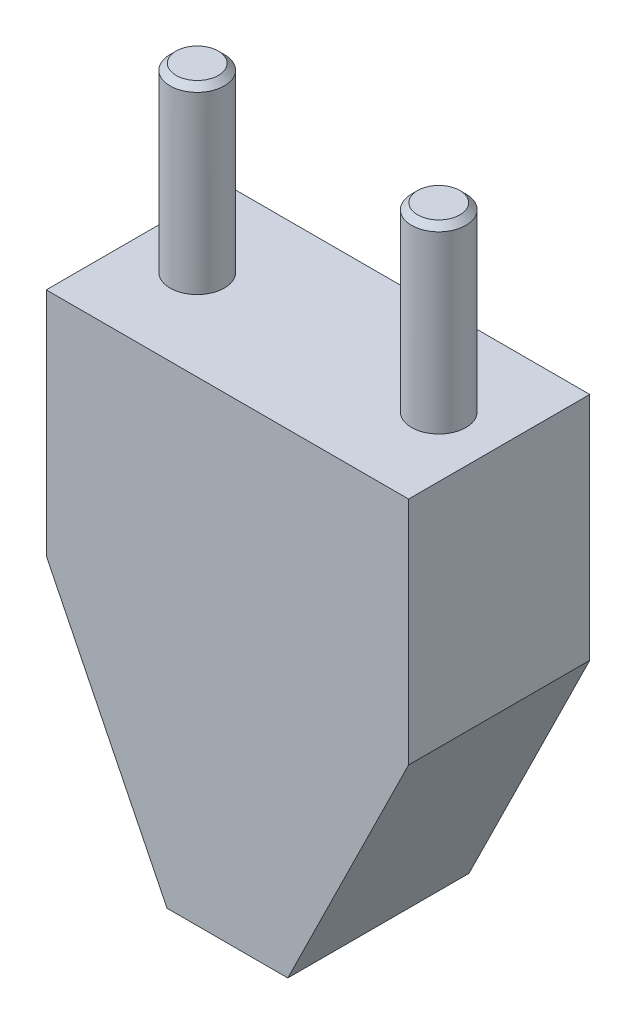
ISO-10303-21;
HEADER;
FILE_DESCRIPTION(('STEP AP214'),'2;1');
FILE_NAME('part.step','',(''),(''),'','','');
FILE_SCHEMA(('AUTOMOTIVE_DESIGN { 1 0 10303 214 1 1 1 1 }'));
ENDSEC;
DATA;
#1=APPLICATION_CONTEXT('core data for automotive mechanical design processes');
#2=APPLICATION_PROTOCOL_DEFINITION('international standard','automotive_design',2000,#1);
#3=PRODUCT_CONTEXT('',#1,'mechanical');
#4=PRODUCT('Part','Part','',(#3));
#5=PRODUCT_RELATED_PRODUCT_CATEGORY('part','',(#4));
#6=PRODUCT_DEFINITION_FORMATION('','',#4);
#7=PRODUCT_DEFINITION_CONTEXT('part definition',#1,'design');
#8=PRODUCT_DEFINITION('design','',#6,#7);
#9=PRODUCT_DEFINITION_SHAPE('','',#8);
#10=(LENGTH_UNIT() NAMED_UNIT(*) SI_UNIT(.MILLI.,.METRE.));
#11=(NAMED_UNIT(*) PLANE_ANGLE_UNIT() SI_UNIT($,.RADIAN.));
#12=(NAMED_UNIT(*) SI_UNIT($,.STERADIAN.) SOLID_ANGLE_UNIT());
#13=UNCERTAINTY_MEASURE_WITH_UNIT(LENGTH_MEASURE(1.E-05),#10,'distance_accuracy_value','');
#14=(GEOMETRIC_REPRESENTATION_CONTEXT(3) GLOBAL_UNCERTAINTY_ASSIGNED_CONTEXT((#13)) GLOBAL_UNIT_ASSIGNED_CONTEXT((#10,
#11,#12)) REPRESENTATION_CONTEXT('',''));
#15=CARTESIAN_POINT('',(0.,0.,0.));
#16=DIRECTION('',(0.,0.,1.));
#17=DIRECTION('',(1.,0.,0.));
#18=AXIS2_PLACEMENT_3D('',#15,#16,#17);
#19=CARTESIAN_POINT('',(-21.2832970929522,-19.069471621051,15.));
#20=DIRECTION('',(1.,0.,0.));
#21=DIRECTION('',(0.,1.,0.));
#22=AXIS2_PLACEMENT_3D('',#19,#20,#21);
#23=PLANE('',#22);
#24=DIRECTION('',(0.,-1.,0.));
#25=VECTOR('',#24,1.);
#26=CARTESIAN_POINT('',(-21.2832970929522,-19.069471621051,0.));
#27=LINE('',#26,#25);
#28=CARTESIAN_POINT('',(-21.2832970929522,0.,0.));
#29=VERTEX_POINT('',#28);
#30=CARTESIAN_POINT('',(-21.2832970929522,-19.069471621051,0.));
#31=VERTEX_POINT('',#30);
#32=EDGE_CURVE('E128',#29,#31,#27,.T.);
#33=ORIENTED_EDGE('',*,*,#32,.T.);
#34=DIRECTION('',(0.,0.,-1.));
#35=VECTOR('',#34,1.);
#36=CARTESIAN_POINT('',(-21.2832970929522,-19.069471621051,15.));
#37=LINE('',#36,#35);
#38=CARTESIAN_POINT('',(-21.2832970929522,-19.069471621051,15.));
#39=VERTEX_POINT('',#38);
#40=EDGE_CURVE('E156',#39,#31,#37,.T.);
#41=ORIENTED_EDGE('',*,*,#40,.F.);
#42=DIRECTION('',(0.,-1.,0.));
#43=VECTOR('',#42,1.);
#44=CARTESIAN_POINT('',(-21.2832970929522,-19.069471621051,15.));
#45=LINE('',#44,#43);
#46=CARTESIAN_POINT('',(-21.2832970929522,0.,15.));
#47=VERTEX_POINT('',#46);
#48=EDGE_CURVE('E145',#47,#39,#45,.T.);
#49=ORIENTED_EDGE('',*,*,#48,.F.);
#50=DIRECTION('',(0.,0.,-1.));
#51=VECTOR('',#50,1.);
#52=CARTESIAN_POINT('',(-21.2832970929522,0.,15.));
#53=LINE('',#52,#51);
#54=EDGE_CURVE('E124',#47,#29,#53,.T.);
#55=ORIENTED_EDGE('',*,*,#54,.T.);
#56=EDGE_LOOP('',(#33,#41,#49,#55));
#57=FACE_BOUND('',#56,.T.);
#58=ADVANCED_FACE('F37',(#57),#23,.F.);
#59=CARTESIAN_POINT('',(-11.2832970929522,-39.3443866876167,15.));
#60=DIRECTION('',(0.896846097486574,0.442342714897739,0.));
#61=DIRECTION('',(-0.442342714897739,0.896846097486574,0.));
#62=AXIS2_PLACEMENT_3D('',#59,#60,#61);
#63=PLANE('',#62);
#64=DIRECTION('',(0.442342714897739,-0.896846097486574,0.));
#65=VECTOR('',#64,1.);
#66=CARTESIAN_POINT('',(-11.2832970929522,-39.3443866876167,0.));
#67=LINE('',#66,#65);
#68=CARTESIAN_POINT('',(-11.2832970929522,-39.3443866876167,0.));
#69=VERTEX_POINT('',#68);
#70=EDGE_CURVE('E132',#31,#69,#67,.T.);
#71=ORIENTED_EDGE('',*,*,#70,.T.);
#72=DIRECTION('',(0.,0.,-1.));
#73=VECTOR('',#72,1.);
#74=CARTESIAN_POINT('',(-11.2832970929522,-39.3443866876167,15.));
#75=LINE('',#74,#73);
#76=CARTESIAN_POINT('',(-11.2832970929522,-39.3443866876167,15.));
#77=VERTEX_POINT('',#76);
#78=EDGE_CURVE('E152',#77,#69,#75,.T.);
#79=ORIENTED_EDGE('',*,*,#78,.F.);
#80=DIRECTION('',(0.442342714897739,-0.896846097486574,0.));
#81=VECTOR('',#80,1.);
#82=CARTESIAN_POINT('',(-11.2832970929522,-39.3443866876167,15.));
#83=LINE('',#82,#81);
#84=EDGE_CURVE('E93',#39,#77,#83,.T.);
#85=ORIENTED_EDGE('',*,*,#84,.F.);
#86=ORIENTED_EDGE('',*,*,#40,.T.);
#87=EDGE_LOOP('',(#71,#79,#85,#86));
#88=FACE_BOUND('',#87,.T.);
#89=ADVANCED_FACE('F194',(#88),#63,.F.);
#90=CARTESIAN_POINT('',(-1.28329709295219,-39.3443866876167,15.));
#91=DIRECTION('',(0.,1.,0.));
#92=DIRECTION('',(0.,0.,1.));
#93=AXIS2_PLACEMENT_3D('',#90,#91,#92);
#94=PLANE('',#93);
#95=CARTESIAN_POINT('',(-6.28329709295219,-39.3443866876167,7.5));
#96=DIRECTION('',(0.,-1.,0.));
#97=DIRECTION('',(0.,0.,-1.));
#98=AXIS2_PLACEMENT_3D('',#95,#96,#97);
#99=CIRCLE('',#98,3.);
#100=CARTESIAN_POINT('',(-6.28329709295219,-39.3443866876167,4.5));
#101=VERTEX_POINT('',#100);
#102=EDGE_CURVE('E241',#101,#101,#99,.T.);
#103=ORIENTED_EDGE('',*,*,#102,.F.);
#104=EDGE_LOOP('',(#103));
#105=FACE_BOUND('',#104,.T.);
#106=DIRECTION('',(1.,0.,0.));
#107=VECTOR('',#106,1.);
#108=CARTESIAN_POINT('',(-1.28329709295219,-39.3443866876167,0.));
#109=LINE('',#108,#107);
#110=CARTESIAN_POINT('',(-1.28329709295219,-39.3443866876167,0.));
#111=VERTEX_POINT('',#110);
#112=EDGE_CURVE('E136',#69,#111,#109,.T.);
#113=ORIENTED_EDGE('',*,*,#112,.T.);
#114=DIRECTION('',(0.,0.,-1.));
#115=VECTOR('',#114,1.);
#116=CARTESIAN_POINT('',(-1.28329709295219,-39.3443866876167,15.));
#117=LINE('',#116,#115);
#118=CARTESIAN_POINT('',(-1.28329709295219,-39.3443866876167,15.));
#119=VERTEX_POINT('',#118);
#120=EDGE_CURVE('E117',#119,#111,#117,.T.);
#121=ORIENTED_EDGE('',*,*,#120,.F.);
#122=DIRECTION('',(1.,0.,0.));
#123=VECTOR('',#122,1.);
#124=CARTESIAN_POINT('',(-1.28329709295219,-39.3443866876167,15.));
#125=LINE('',#124,#123);
#126=EDGE_CURVE('E106',#77,#119,#125,.T.);
#127=ORIENTED_EDGE('',*,*,#126,.F.);
#128=ORIENTED_EDGE('',*,*,#78,.T.);
#129=EDGE_LOOP('',(#113,#121,#127,#128));
#130=FACE_BOUND('',#129,.T.);
#131=ADVANCED_FACE('F200',(#105,#130),#94,.F.);
#132=CARTESIAN_POINT('',(8.7167029070478,-19.069471621051,15.));
#133=DIRECTION('',(-0.896846097486574,0.442342714897739,0.));
#134=DIRECTION('',(-0.442342714897739,-0.896846097486574,0.));
#135=AXIS2_PLACEMENT_3D('',#132,#133,#134);
#136=PLANE('',#135);
#137=DIRECTION('',(0.442342714897739,0.896846097486574,0.));
#138=VECTOR('',#137,1.);
#139=CARTESIAN_POINT('',(8.7167029070478,-19.069471621051,0.));
#140=LINE('',#139,#138);
#141=CARTESIAN_POINT('',(8.7167029070478,-19.069471621051,0.));
#142=VERTEX_POINT('',#141);
#143=EDGE_CURVE('E115',#111,#142,#140,.T.);
#144=ORIENTED_EDGE('',*,*,#143,.T.);
#145=DIRECTION('',(0.,0.,-1.));
#146=VECTOR('',#145,1.);
#147=CARTESIAN_POINT('',(8.7167029070478,-19.069471621051,15.));
#148=LINE('',#147,#146);
#149=CARTESIAN_POINT('',(8.7167029070478,-19.069471621051,15.));
#150=VERTEX_POINT('',#149);
#151=EDGE_CURVE('E112',#150,#142,#148,.T.);
#152=ORIENTED_EDGE('',*,*,#151,.F.);
#153=DIRECTION('',(0.442342714897739,0.896846097486574,0.));
#154=VECTOR('',#153,1.);
#155=CARTESIAN_POINT('',(8.7167029070478,-19.069471621051,15.));
#156=LINE('',#155,#154);
#157=EDGE_CURVE('E100',#119,#150,#156,.T.);
#158=ORIENTED_EDGE('',*,*,#157,.F.);
#159=ORIENTED_EDGE('',*,*,#120,.T.);
#160=EDGE_LOOP('',(#144,#152,#158,#159));
#161=FACE_BOUND('',#160,.T.);
#162=ADVANCED_FACE('F113',(#161),#136,.F.);
#163=CARTESIAN_POINT('',(8.7167029070478,0.,15.));
#164=DIRECTION('',(-1.,0.,0.));
#165=DIRECTION('',(0.,-1.,0.));
#166=AXIS2_PLACEMENT_3D('',#163,#164,#165);
#167=PLANE('',#166);
#168=DIRECTION('',(0.,1.,0.));
#169=VECTOR('',#168,1.);
#170=CARTESIAN_POINT('',(8.7167029070478,0.,0.));
#171=LINE('',#170,#169);
#172=CARTESIAN_POINT('',(8.7167029070478,0.,0.));
#173=VERTEX_POINT('',#172);
#174=EDGE_CURVE('E78',#142,#173,#171,.T.);
#175=ORIENTED_EDGE('',*,*,#174,.T.);
#176=DIRECTION('',(0.,0.,-1.));
#177=VECTOR('',#176,1.);
#178=CARTESIAN_POINT('',(8.7167029070478,0.,15.));
#179=LINE('',#178,#177);
#180=CARTESIAN_POINT('',(8.7167029070478,0.,15.));
#181=VERTEX_POINT('',#180);
#182=EDGE_CURVE('E118',#181,#173,#179,.T.);
#183=ORIENTED_EDGE('',*,*,#182,.F.);
#184=DIRECTION('',(0.,1.,0.));
#185=VECTOR('',#184,1.);
#186=CARTESIAN_POINT('',(8.7167029070478,0.,15.));
#187=LINE('',#186,#185);
#188=EDGE_CURVE('E104',#150,#181,#187,.T.);
#189=ORIENTED_EDGE('',*,*,#188,.F.);
#190=ORIENTED_EDGE('',*,*,#151,.T.);
#191=EDGE_LOOP('',(#175,#183,#189,#190));
#192=FACE_BOUND('',#191,.T.);
#193=ADVANCED_FACE('F120',(#192),#167,.F.);
#194=CARTESIAN_POINT('',(-21.2832970929522,0.,15.));
#195=DIRECTION('',(0.,-1.,0.));
#196=DIRECTION('',(1.,0.,0.));
#197=AXIS2_PLACEMENT_3D('',#194,#195,#196);
#198=PLANE('',#197);
#199=CARTESIAN_POINT('',(3.7167029070478,0.,7.5));
#200=DIRECTION('',(0.,-1.,0.));
#201=DIRECTION('',(1.,0.,0.));
#202=AXIS2_PLACEMENT_3D('',#199,#200,#201);
#203=CIRCLE('',#202,2.25);
#204=CARTESIAN_POINT('',(5.9667029070478,0.,7.5));
#205=VERTEX_POINT('',#204);
#206=EDGE_CURVE('E163',#205,#205,#203,.F.);
#207=ORIENTED_EDGE('',*,*,#206,.F.);
#208=EDGE_LOOP('',(#207));
#209=FACE_BOUND('',#208,.T.);
#210=CARTESIAN_POINT('',(-16.2832970929522,0.,7.5));
#211=DIRECTION('',(0.,-1.,0.));
#212=DIRECTION('',(1.,0.,0.));
#213=AXIS2_PLACEMENT_3D('',#210,#211,#212);
#214=CIRCLE('',#213,2.25);
#215=CARTESIAN_POINT('',(-14.0332970929522,0.,7.5));
#216=VERTEX_POINT('',#215);
#217=EDGE_CURVE('E159',#216,#216,#214,.F.);
#218=ORIENTED_EDGE('',*,*,#217,.F.);
#219=EDGE_LOOP('',(#218));
#220=FACE_BOUND('',#219,.T.);
#221=DIRECTION('',(-1.,0.,0.));
#222=VECTOR('',#221,1.);
#223=CARTESIAN_POINT('',(-21.2832970929522,0.,0.));
#224=LINE('',#223,#222);
#225=EDGE_CURVE('E84',#173,#29,#224,.T.);
#226=ORIENTED_EDGE('',*,*,#225,.T.);
#227=ORIENTED_EDGE('',*,*,#54,.F.);
#228=DIRECTION('',(-1.,0.,0.));
#229=VECTOR('',#228,1.);
#230=CARTESIAN_POINT('',(-21.2832970929522,0.,15.));
#231=LINE('',#230,#229);
#232=EDGE_CURVE('E55',#181,#47,#231,.T.);
#233=ORIENTED_EDGE('',*,*,#232,.F.);
#234=ORIENTED_EDGE('',*,*,#182,.T.);
#235=EDGE_LOOP('',(#226,#227,#233,#234));
#236=FACE_BOUND('',#235,.T.);
#237=ADVANCED_FACE('F210',(#209,#220,#236),#198,.F.);
#238=CARTESIAN_POINT('',(0.,0.,15.));
#239=DIRECTION('',(0.,0.,-1.));
#240=DIRECTION('',(-1.,0.,0.));
#241=AXIS2_PLACEMENT_3D('',#238,#239,#240);
#242=PLANE('',#241);
#243=ORIENTED_EDGE('',*,*,#48,.T.);
#244=ORIENTED_EDGE('',*,*,#84,.T.);
#245=ORIENTED_EDGE('',*,*,#126,.T.);
#246=ORIENTED_EDGE('',*,*,#157,.T.);
#247=ORIENTED_EDGE('',*,*,#188,.T.);
#248=ORIENTED_EDGE('',*,*,#232,.T.);
#249=EDGE_LOOP('',(#243,#244,#245,#246,#247,#248));
#250=FACE_BOUND('',#249,.T.);
#251=ADVANCED_FACE('F102',(#250),#242,.F.);
#252=CARTESIAN_POINT('',(0.,0.,0.));
#253=DIRECTION('',(0.,0.,-1.));
#254=DIRECTION('',(-1.,0.,0.));
#255=AXIS2_PLACEMENT_3D('',#252,#253,#254);
#256=PLANE('',#255);
#257=ORIENTED_EDGE('',*,*,#32,.F.);
#258=ORIENTED_EDGE('',*,*,#225,.F.);
#259=ORIENTED_EDGE('',*,*,#174,.F.);
#260=ORIENTED_EDGE('',*,*,#143,.F.);
#261=ORIENTED_EDGE('',*,*,#112,.F.);
#262=ORIENTED_EDGE('',*,*,#70,.F.);
#263=EDGE_LOOP('',(#257,#258,#259,#260,#261,#262));
#264=FACE_BOUND('',#263,.T.);
#265=ADVANCED_FACE('F214',(#264),#256,.T.);
#266=CARTESIAN_POINT('',(-16.2832970929522,15.,7.5));
#267=DIRECTION('',(0.,-1.,0.));
#268=DIRECTION('',(1.,0.,0.));
#269=AXIS2_PLACEMENT_3D('',#266,#267,#268);
#270=CYLINDRICAL_SURFACE('',#269,2.25);
#271=CARTESIAN_POINT('',(-16.2832970929522,14.5,7.5));
#272=DIRECTION('',(0.,1.,0.));
#273=DIRECTION('',(0.,0.,1.));
#274=AXIS2_PLACEMENT_3D('',#271,#272,#273);
#275=CIRCLE('',#274,2.25);
#276=CARTESIAN_POINT('',(-16.2832970929522,14.5,9.75));
#277=VERTEX_POINT('',#276);
#278=EDGE_CURVE('E171',#277,#277,#275,.F.);
#279=ORIENTED_EDGE('',*,*,#278,.T.);
#280=EDGE_LOOP('',(#279));
#281=FACE_BOUND('',#280,.T.);
#282=ORIENTED_EDGE('',*,*,#217,.T.);
#283=EDGE_LOOP('',(#282));
#284=FACE_BOUND('',#283,.T.);
#285=ADVANCED_FACE('F217',(#281,#284),#270,.T.);
#286=CARTESIAN_POINT('',(-16.2832970929522,15.,7.5));
#287=DIRECTION('',(0.,1.,0.));
#288=DIRECTION('',(-1.,0.,0.));
#289=AXIS2_PLACEMENT_3D('',#286,#287,#288);
#290=PLANE('',#289);
#291=CARTESIAN_POINT('',(-16.2832970929522,15.,7.5));
#292=DIRECTION('',(0.,1.,0.));
#293=DIRECTION('',(-1.,0.,0.));
#294=AXIS2_PLACEMENT_3D('',#291,#292,#293);
#295=CIRCLE('',#294,1.74999999999999);
#296=CARTESIAN_POINT('',(-18.0332970929522,15.,7.5));
#297=VERTEX_POINT('',#296);
#298=EDGE_CURVE('E167',#297,#297,#295,.T.);
#299=ORIENTED_EDGE('',*,*,#298,.T.);
#300=EDGE_LOOP('',(#299));
#301=FACE_BOUND('',#300,.T.);
#302=ADVANCED_FACE('F223',(#301),#290,.T.);
#303=CARTESIAN_POINT('',(3.7167029070478,15.,7.5));
#304=DIRECTION('',(0.,-1.,0.));
#305=DIRECTION('',(1.,0.,0.));
#306=AXIS2_PLACEMENT_3D('',#303,#304,#305);
#307=CYLINDRICAL_SURFACE('',#306,2.25);
#308=CARTESIAN_POINT('',(3.7167029070478,14.5,7.5));
#309=DIRECTION('',(0.,1.,0.));
#310=DIRECTION('',(0.,0.,1.));
#311=AXIS2_PLACEMENT_3D('',#308,#309,#310);
#312=CIRCLE('',#311,2.25);
#313=CARTESIAN_POINT('',(3.7167029070478,14.5,9.75));
#314=VERTEX_POINT('',#313);
#315=EDGE_CURVE('E11',#314,#314,#312,.F.);
#316=ORIENTED_EDGE('',*,*,#315,.T.);
#317=EDGE_LOOP('',(#316));
#318=FACE_BOUND('',#317,.T.);
#319=ORIENTED_EDGE('',*,*,#206,.T.);
#320=EDGE_LOOP('',(#319));
#321=FACE_BOUND('',#320,.T.);
#322=ADVANCED_FACE('F227',(#318,#321),#307,.T.);
#323=CARTESIAN_POINT('',(3.7167029070478,15.,7.5));
#324=DIRECTION('',(0.,1.,0.));
#325=DIRECTION('',(-1.,0.,0.));
#326=AXIS2_PLACEMENT_3D('',#323,#324,#325);
#327=PLANE('',#326);
#328=CARTESIAN_POINT('',(3.7167029070478,15.,7.5));
#329=DIRECTION('',(0.,1.,0.));
#330=DIRECTION('',(-1.,0.,0.));
#331=AXIS2_PLACEMENT_3D('',#328,#329,#330);
#332=CIRCLE('',#331,1.74999999999999);
#333=CARTESIAN_POINT('',(1.96670290704781,15.,7.5));
#334=VERTEX_POINT('',#333);
#335=EDGE_CURVE('E47',#334,#334,#332,.T.);
#336=ORIENTED_EDGE('',*,*,#335,.T.);
#337=EDGE_LOOP('',(#336));
#338=FACE_BOUND('',#337,.T.);
#339=ADVANCED_FACE('F178',(#338),#327,.T.);
#340=CARTESIAN_POINT('',(-16.2832970929522,15.,7.5));
#341=DIRECTION('',(0.,-1.,0.));
#342=DIRECTION('',(0.,0.,-1.));
#343=AXIS2_PLACEMENT_3D('',#340,#341,#342);
#344=CONICAL_SURFACE('',#343,1.74999999999999,0.78539816339744);
#345=ORIENTED_EDGE('',*,*,#278,.F.);
#346=EDGE_LOOP('',(#345));
#347=FACE_BOUND('',#346,.T.);
#348=ORIENTED_EDGE('',*,*,#298,.F.);
#349=EDGE_LOOP('',(#348));
#350=FACE_BOUND('',#349,.T.);
#351=ADVANCED_FACE('F182',(#347,#350),#344,.T.);
#352=CARTESIAN_POINT('',(3.7167029070478,15.,7.5));
#353=DIRECTION('',(0.,-1.,0.));
#354=DIRECTION('',(0.,0.,-1.));
#355=AXIS2_PLACEMENT_3D('',#352,#353,#354);
#356=CONICAL_SURFACE('',#355,1.74999999999999,0.78539816339744);
#357=ORIENTED_EDGE('',*,*,#315,.F.);
#358=EDGE_LOOP('',(#357));
#359=FACE_BOUND('',#358,.T.);
#360=ORIENTED_EDGE('',*,*,#335,.F.);
#361=EDGE_LOOP('',(#360));
#362=FACE_BOUND('',#361,.T.);
#363=ADVANCED_FACE('F39',(#359,#362),#356,.T.);
#364=CARTESIAN_POINT('',(-6.28329709295219,-34.3443866876167,7.5));
#365=DIRECTION('',(0.,-1.,0.));
#366=DIRECTION('',(0.,0.,-1.));
#367=AXIS2_PLACEMENT_3D('',#364,#365,#366);
#368=CYLINDRICAL_SURFACE('',#367,3.);
#369=CARTESIAN_POINT('',(-6.28329709295219,-34.3443866876167,7.5));
#370=DIRECTION('',(0.,-1.,0.));
#371=DIRECTION('',(0.,0.,-1.));
#372=AXIS2_PLACEMENT_3D('',#369,#370,#371);
#373=CIRCLE('',#372,3.);
#374=CARTESIAN_POINT('',(-6.28329709295219,-34.3443866876167,4.5));
#375=VERTEX_POINT('',#374);
#376=EDGE_CURVE('E133',#375,#375,#373,.T.);
#377=ORIENTED_EDGE('',*,*,#376,.F.);
#378=EDGE_LOOP('',(#377));
#379=FACE_BOUND('',#378,.T.);
#380=ORIENTED_EDGE('',*,*,#102,.T.);
#381=EDGE_LOOP('',(#380));
#382=FACE_BOUND('',#381,.T.);
#383=ADVANCED_FACE('F181',(#379,#382),#368,.F.);
#384=CARTESIAN_POINT('',(-6.28329709295219,-34.3443866876167,7.5));
#385=DIRECTION('',(0.,-1.,0.));
#386=DIRECTION('',(0.,0.,-1.));
#387=AXIS2_PLACEMENT_3D('',#384,#385,#386);
#388=PLANE('',#387);
#389=ORIENTED_EDGE('',*,*,#376,.T.);
#390=EDGE_LOOP('',(#389));
#391=FACE_BOUND('',#390,.T.);
#392=ADVANCED_FACE('F188',(#391),#388,.T.);
#393=CLOSED_SHELL('',(#58,#89,#131,#162,#193,#237,#251,#265,#285,#302,#322,#339,#351,#363,#383,#392));
#394=MANIFOLD_SOLID_BREP('B2',#393);
#395=ADVANCED_BREP_SHAPE_REPRESENTATION('',(#18,#394),#14);
#396=SHAPE_DEFINITION_REPRESENTATION(#9,#395);
ENDSEC;
END-ISO-10303-21;
